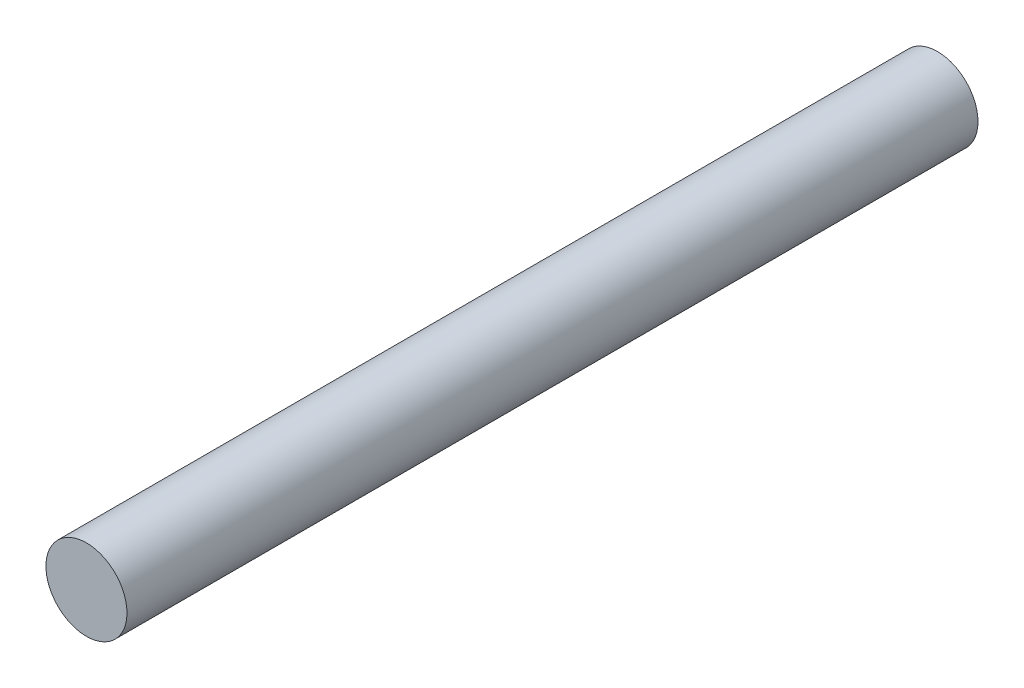
ISO-10303-21;
HEADER;
FILE_DESCRIPTION(('STEP AP214'),'2;1');
FILE_NAME('part.step','',(''),(''),'','','');
FILE_SCHEMA(('AUTOMOTIVE_DESIGN { 1 0 10303 214 1 1 1 1 }'));
ENDSEC;
DATA;
#1=APPLICATION_CONTEXT('core data for automotive mechanical design processes');
#2=APPLICATION_PROTOCOL_DEFINITION('international standard','automotive_design',2000,#1);
#3=PRODUCT_CONTEXT('',#1,'mechanical');
#4=PRODUCT('Part','Part','',(#3));
#5=PRODUCT_RELATED_PRODUCT_CATEGORY('part','',(#4));
#6=PRODUCT_DEFINITION_FORMATION('','',#4);
#7=PRODUCT_DEFINITION_CONTEXT('part definition',#1,'design');
#8=PRODUCT_DEFINITION('design','',#6,#7);
#9=PRODUCT_DEFINITION_SHAPE('','',#8);
#10=(LENGTH_UNIT() NAMED_UNIT(*) SI_UNIT(.MILLI.,.METRE.));
#11=(NAMED_UNIT(*) PLANE_ANGLE_UNIT() SI_UNIT($,.RADIAN.));
#12=(NAMED_UNIT(*) SI_UNIT($,.STERADIAN.) SOLID_ANGLE_UNIT());
#13=UNCERTAINTY_MEASURE_WITH_UNIT(LENGTH_MEASURE(1.E-05),#10,'distance_accuracy_value','');
#14=(GEOMETRIC_REPRESENTATION_CONTEXT(3) GLOBAL_UNCERTAINTY_ASSIGNED_CONTEXT((#13)) GLOBAL_UNIT_ASSIGNED_CONTEXT((#10,
#11,#12)) REPRESENTATION_CONTEXT('',''));
#15=CARTESIAN_POINT('',(0.,0.,0.));
#16=DIRECTION('',(0.,0.,1.));
#17=DIRECTION('',(1.,0.,0.));
#18=AXIS2_PLACEMENT_3D('',#15,#16,#17);
#19=CARTESIAN_POINT('',(0.,0.,420.));
#20=DIRECTION('',(0.,0.,-1.));
#21=DIRECTION('',(-1.,0.,0.));
#22=AXIS2_PLACEMENT_3D('',#19,#20,#21);
#23=CYLINDRICAL_SURFACE('',#22,20.);
#24=CARTESIAN_POINT('',(0.,0.,420.));
#25=DIRECTION('',(0.,0.,1.));
#26=DIRECTION('',(1.,0.,0.));
#27=AXIS2_PLACEMENT_3D('',#24,#25,#26);
#28=CIRCLE('',#27,20.);
#29=CARTESIAN_POINT('',(20.,0.,420.));
#30=VERTEX_POINT('',#29);
#31=EDGE_CURVE('E12',#30,#30,#28,.T.);
#32=ORIENTED_EDGE('',*,*,#31,.F.);
#33=EDGE_LOOP('',(#32));
#34=FACE_BOUND('',#33,.T.);
#35=CARTESIAN_POINT('',(0.,0.,0.));
#36=DIRECTION('',(0.,0.,1.));
#37=DIRECTION('',(1.,0.,0.));
#38=AXIS2_PLACEMENT_3D('',#35,#36,#37);
#39=CIRCLE('',#38,20.);
#40=CARTESIAN_POINT('',(20.,0.,0.));
#41=VERTEX_POINT('',#40);
#42=EDGE_CURVE('E43',#41,#41,#39,.T.);
#43=ORIENTED_EDGE('',*,*,#42,.T.);
#44=EDGE_LOOP('',(#43));
#45=FACE_BOUND('',#44,.T.);
#46=ADVANCED_FACE('F40',(#34,#45),#23,.T.);
#47=CARTESIAN_POINT('',(0.,0.,420.));
#48=DIRECTION('',(0.,0.,1.));
#49=DIRECTION('',(1.,0.,0.));
#50=AXIS2_PLACEMENT_3D('',#47,#48,#49);
#51=PLANE('',#50);
#52=ORIENTED_EDGE('',*,*,#31,.T.);
#53=EDGE_LOOP('',(#52));
#54=FACE_BOUND('',#53,.T.);
#55=ADVANCED_FACE('F55',(#54),#51,.T.);
#56=CARTESIAN_POINT('',(0.,0.,0.));
#57=DIRECTION('',(0.,0.,1.));
#58=DIRECTION('',(1.,0.,0.));
#59=AXIS2_PLACEMENT_3D('',#56,#57,#58);
#60=PLANE('',#59);
#61=ORIENTED_EDGE('',*,*,#42,.F.);
#62=EDGE_LOOP('',(#61));
#63=FACE_BOUND('',#62,.T.);
#64=ADVANCED_FACE('F53',(#63),#60,.F.);
#65=CLOSED_SHELL('',(#46,#55,#64));
#66=MANIFOLD_SOLID_BREP('B2',#65);
#67=ADVANCED_BREP_SHAPE_REPRESENTATION('',(#18,#66),#14);
#68=SHAPE_DEFINITION_REPRESENTATION(#9,#67);
ENDSEC;
END-ISO-10303-21;
